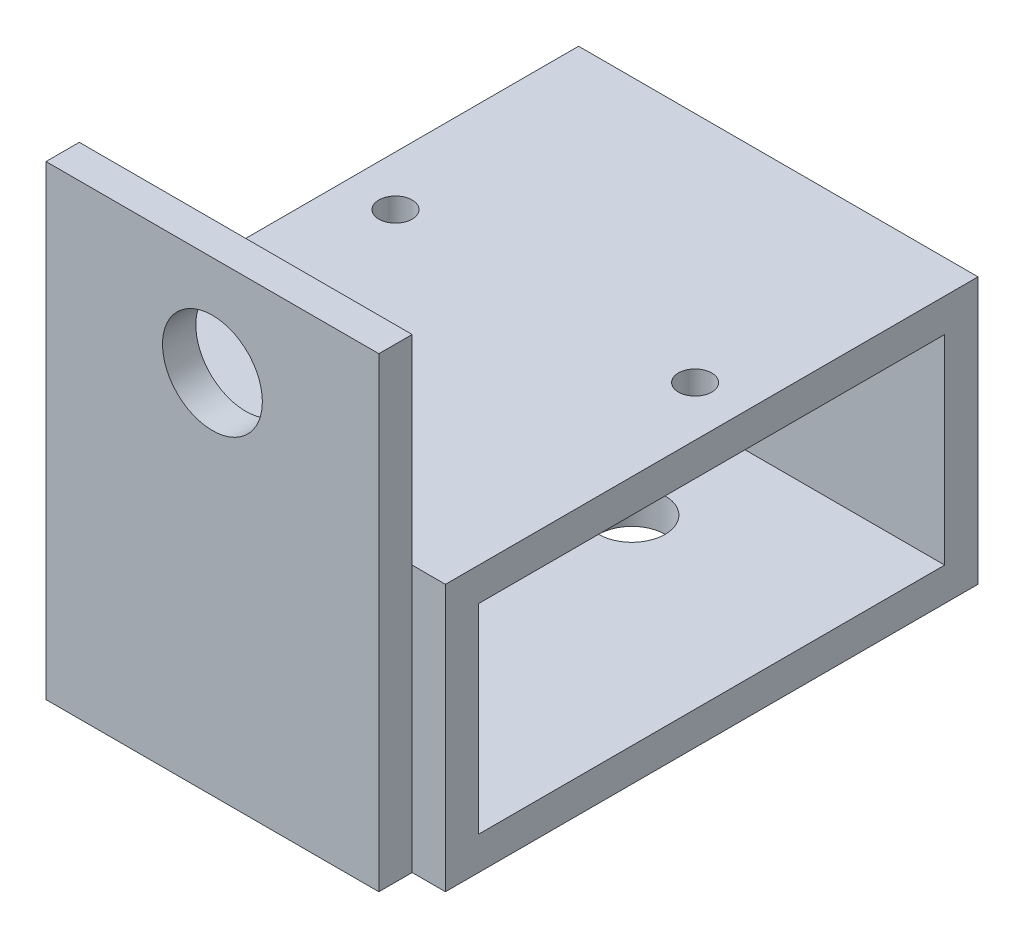
ISO-10303-21;
HEADER;
FILE_DESCRIPTION(('STEP AP214'),'2;1');
FILE_NAME('part.step','',(''),(''),'','','');
FILE_SCHEMA(('AUTOMOTIVE_DESIGN { 1 0 10303 214 1 1 1 1 }'));
ENDSEC;
DATA;
#1=APPLICATION_CONTEXT('core data for automotive mechanical design processes');
#2=APPLICATION_PROTOCOL_DEFINITION('international standard','automotive_design',2000,#1);
#3=PRODUCT_CONTEXT('',#1,'mechanical');
#4=PRODUCT('Part','Part','',(#3));
#5=PRODUCT_RELATED_PRODUCT_CATEGORY('part','',(#4));
#6=PRODUCT_DEFINITION_FORMATION('','',#4);
#7=PRODUCT_DEFINITION_CONTEXT('part definition',#1,'design');
#8=PRODUCT_DEFINITION('design','',#6,#7);
#9=PRODUCT_DEFINITION_SHAPE('','',#8);
#10=(LENGTH_UNIT() NAMED_UNIT(*) SI_UNIT(.MILLI.,.METRE.));
#11=(NAMED_UNIT(*) PLANE_ANGLE_UNIT() SI_UNIT($,.RADIAN.));
#12=(NAMED_UNIT(*) SI_UNIT($,.STERADIAN.) SOLID_ANGLE_UNIT());
#13=UNCERTAINTY_MEASURE_WITH_UNIT(LENGTH_MEASURE(1.E-05),#10,'distance_accuracy_value','');
#14=(GEOMETRIC_REPRESENTATION_CONTEXT(3) GLOBAL_UNCERTAINTY_ASSIGNED_CONTEXT((#13)) GLOBAL_UNIT_ASSIGNED_CONTEXT((#10,
#11,#12)) REPRESENTATION_CONTEXT('',''));
#15=CARTESIAN_POINT('',(0.,0.,0.));
#16=DIRECTION('',(0.,0.,1.));
#17=DIRECTION('',(1.,0.,0.));
#18=AXIS2_PLACEMENT_3D('',#15,#16,#17);
#19=CARTESIAN_POINT('',(19.05,-12.7,25.4));
#20=DIRECTION('',(0.,0.,-1.));
#21=DIRECTION('',(-1.,0.,0.));
#22=AXIS2_PLACEMENT_3D('',#19,#20,#21);
#23=PLANE('',#22);
#24=DIRECTION('',(0.,-1.,0.));
#25=VECTOR('',#24,1.);
#26=CARTESIAN_POINT('',(-15.875,31.75,25.4));
#27=LINE('',#26,#25);
#28=CARTESIAN_POINT('',(-15.875,12.7,25.4));
#29=VERTEX_POINT('',#28);
#30=CARTESIAN_POINT('',(-15.875,-12.7,25.4));
#31=VERTEX_POINT('',#30);
#32=EDGE_CURVE('E12',#29,#31,#27,.T.);
#33=ORIENTED_EDGE('',*,*,#32,.F.);
#34=DIRECTION('',(-1.,0.,0.));
#35=VECTOR('',#34,1.);
#36=CARTESIAN_POINT('',(19.05,12.7,25.4));
#37=LINE('',#36,#35);
#38=CARTESIAN_POINT('',(-19.05,12.7,25.4));
#39=VERTEX_POINT('',#38);
#40=EDGE_CURVE('E290',#29,#39,#37,.T.);
#41=ORIENTED_EDGE('',*,*,#40,.T.);
#42=DIRECTION('',(0.,-1.,0.));
#43=VECTOR('',#42,1.);
#44=CARTESIAN_POINT('',(-19.05,-12.7,25.4));
#45=LINE('',#44,#43);
#46=CARTESIAN_POINT('',(-19.05,-12.7,25.4));
#47=VERTEX_POINT('',#46);
#48=EDGE_CURVE('E260',#39,#47,#45,.T.);
#49=ORIENTED_EDGE('',*,*,#48,.T.);
#50=DIRECTION('',(-1.,0.,0.));
#51=VECTOR('',#50,1.);
#52=CARTESIAN_POINT('',(19.05,-12.7,25.4));
#53=LINE('',#52,#51);
#54=EDGE_CURVE('E196',#31,#47,#53,.T.);
#55=ORIENTED_EDGE('',*,*,#54,.F.);
#56=EDGE_LOOP('',(#33,#41,#49,#55));
#57=FACE_BOUND('',#56,.T.);
#58=ADVANCED_FACE('F59',(#57),#23,.F.);
#59=CARTESIAN_POINT('',(19.05,0.,0.));
#60=DIRECTION('',(1.,0.,0.));
#61=DIRECTION('',(0.,0.,-1.));
#62=AXIS2_PLACEMENT_3D('',#59,#60,#61);
#63=PLANE('',#62);
#64=DIRECTION('',(0.,1.,0.));
#65=VECTOR('',#64,1.);
#66=CARTESIAN_POINT('',(19.05,-12.7,-25.4));
#67=LINE('',#66,#65);
#68=CARTESIAN_POINT('',(19.05,-12.7,-25.4));
#69=VERTEX_POINT('',#68);
#70=CARTESIAN_POINT('',(19.05,12.7,-25.4));
#71=VERTEX_POINT('',#70);
#72=EDGE_CURVE('E259',#69,#71,#67,.T.);
#73=ORIENTED_EDGE('',*,*,#72,.T.);
#74=DIRECTION('',(0.,0.,1.));
#75=VECTOR('',#74,1.);
#76=CARTESIAN_POINT('',(19.05,12.7,25.4));
#77=LINE('',#76,#75);
#78=CARTESIAN_POINT('',(19.05,12.7,25.4));
#79=VERTEX_POINT('',#78);
#80=EDGE_CURVE('E521',#71,#79,#77,.T.);
#81=ORIENTED_EDGE('',*,*,#80,.T.);
#82=DIRECTION('',(0.,-1.,0.));
#83=VECTOR('',#82,1.);
#84=CARTESIAN_POINT('',(19.05,-12.7,25.4));
#85=LINE('',#84,#83);
#86=CARTESIAN_POINT('',(19.05,-12.7,25.4));
#87=VERTEX_POINT('',#86);
#88=EDGE_CURVE('E522',#79,#87,#85,.T.);
#89=ORIENTED_EDGE('',*,*,#88,.T.);
#90=DIRECTION('',(0.,0.,-1.));
#91=VECTOR('',#90,1.);
#92=CARTESIAN_POINT('',(19.05,-12.7,25.4));
#93=LINE('',#92,#91);
#94=EDGE_CURVE('E267',#87,#69,#93,.T.);
#95=ORIENTED_EDGE('',*,*,#94,.T.);
#96=EDGE_LOOP('',(#73,#81,#89,#95));
#97=FACE_BOUND('',#96,.T.);
#98=DIRECTION('',(0.,0.,1.));
#99=VECTOR('',#98,1.);
#100=CARTESIAN_POINT('',(19.05,9.525,0.));
#101=LINE('',#100,#99);
#102=CARTESIAN_POINT('',(19.05,9.525,-22.225));
#103=VERTEX_POINT('',#102);
#104=CARTESIAN_POINT('',(19.05,9.525,22.225));
#105=VERTEX_POINT('',#104);
#106=EDGE_CURVE('E530',#103,#105,#101,.T.);
#107=ORIENTED_EDGE('',*,*,#106,.F.);
#108=DIRECTION('',(0.,1.,0.));
#109=VECTOR('',#108,1.);
#110=CARTESIAN_POINT('',(19.05,0.,-22.225));
#111=LINE('',#110,#109);
#112=CARTESIAN_POINT('',(19.05,-9.525,-22.225));
#113=VERTEX_POINT('',#112);
#114=EDGE_CURVE('E505',#113,#103,#111,.T.);
#115=ORIENTED_EDGE('',*,*,#114,.F.);
#116=DIRECTION('',(0.,0.,-1.));
#117=VECTOR('',#116,1.);
#118=CARTESIAN_POINT('',(19.05,-9.525,0.));
#119=LINE('',#118,#117);
#120=CARTESIAN_POINT('',(19.05,-9.525,22.225));
#121=VERTEX_POINT('',#120);
#122=EDGE_CURVE('E517',#121,#113,#119,.T.);
#123=ORIENTED_EDGE('',*,*,#122,.F.);
#124=DIRECTION('',(0.,-1.,0.));
#125=VECTOR('',#124,1.);
#126=CARTESIAN_POINT('',(19.05,0.,22.225));
#127=LINE('',#126,#125);
#128=EDGE_CURVE('E532',#105,#121,#127,.T.);
#129=ORIENTED_EDGE('',*,*,#128,.F.);
#130=EDGE_LOOP('',(#107,#115,#123,#129));
#131=FACE_BOUND('',#130,.T.);
#132=ADVANCED_FACE('F312',(#97,#131),#63,.T.);
#133=CARTESIAN_POINT('',(-19.05,0.,0.));
#134=DIRECTION('',(1.,0.,0.));
#135=DIRECTION('',(0.,0.,-1.));
#136=AXIS2_PLACEMENT_3D('',#133,#134,#135);
#137=PLANE('',#136);
#138=DIRECTION('',(0.,1.,0.));
#139=VECTOR('',#138,1.);
#140=CARTESIAN_POINT('',(-19.05,-12.7,-25.4));
#141=LINE('',#140,#139);
#142=CARTESIAN_POINT('',(-19.05,-12.7,-25.4));
#143=VERTEX_POINT('',#142);
#144=CARTESIAN_POINT('',(-19.05,12.7,-25.4));
#145=VERTEX_POINT('',#144);
#146=EDGE_CURVE('E265',#143,#145,#141,.T.);
#147=ORIENTED_EDGE('',*,*,#146,.F.);
#148=DIRECTION('',(0.,0.,-1.));
#149=VECTOR('',#148,1.);
#150=CARTESIAN_POINT('',(-19.05,-12.7,25.4));
#151=LINE('',#150,#149);
#152=EDGE_CURVE('E248',#47,#143,#151,.T.);
#153=ORIENTED_EDGE('',*,*,#152,.F.);
#154=ORIENTED_EDGE('',*,*,#48,.F.);
#155=DIRECTION('',(0.,0.,1.));
#156=VECTOR('',#155,1.);
#157=CARTESIAN_POINT('',(-19.05,12.7,25.4));
#158=LINE('',#157,#156);
#159=EDGE_CURVE('E272',#145,#39,#158,.T.);
#160=ORIENTED_EDGE('',*,*,#159,.F.);
#161=EDGE_LOOP('',(#147,#153,#154,#160));
#162=FACE_BOUND('',#161,.T.);
#163=DIRECTION('',(0.,1.,0.));
#164=VECTOR('',#163,1.);
#165=CARTESIAN_POINT('',(-19.05,0.,-22.225));
#166=LINE('',#165,#164);
#167=CARTESIAN_POINT('',(-19.05,-9.525,-22.225));
#168=VERTEX_POINT('',#167);
#169=CARTESIAN_POINT('',(-19.05,9.525,-22.225));
#170=VERTEX_POINT('',#169);
#171=EDGE_CURVE('E189',#168,#170,#166,.T.);
#172=ORIENTED_EDGE('',*,*,#171,.T.);
#173=DIRECTION('',(0.,0.,1.));
#174=VECTOR('',#173,1.);
#175=CARTESIAN_POINT('',(-19.05,9.525,0.));
#176=LINE('',#175,#174);
#177=CARTESIAN_POINT('',(-19.05,9.525,22.225));
#178=VERTEX_POINT('',#177);
#179=EDGE_CURVE('E510',#170,#178,#176,.T.);
#180=ORIENTED_EDGE('',*,*,#179,.T.);
#181=DIRECTION('',(0.,-1.,0.));
#182=VECTOR('',#181,1.);
#183=CARTESIAN_POINT('',(-19.05,0.,22.225));
#184=LINE('',#183,#182);
#185=CARTESIAN_POINT('',(-19.05,-9.525,22.225));
#186=VERTEX_POINT('',#185);
#187=EDGE_CURVE('E506',#178,#186,#184,.T.);
#188=ORIENTED_EDGE('',*,*,#187,.T.);
#189=DIRECTION('',(0.,0.,-1.));
#190=VECTOR('',#189,1.);
#191=CARTESIAN_POINT('',(-19.05,-9.525,0.));
#192=LINE('',#191,#190);
#193=EDGE_CURVE('E500',#186,#168,#192,.T.);
#194=ORIENTED_EDGE('',*,*,#193,.T.);
#195=EDGE_LOOP('',(#172,#180,#188,#194));
#196=FACE_BOUND('',#195,.T.);
#197=ADVANCED_FACE('F269',(#162,#196),#137,.F.);
#198=CARTESIAN_POINT('',(19.05,-12.7,-25.4));
#199=DIRECTION('',(0.,0.,1.));
#200=DIRECTION('',(1.,0.,0.));
#201=AXIS2_PLACEMENT_3D('',#198,#199,#200);
#202=PLANE('',#201);
#203=ORIENTED_EDGE('',*,*,#146,.T.);
#204=DIRECTION('',(-1.,0.,0.));
#205=VECTOR('',#204,1.);
#206=CARTESIAN_POINT('',(19.05,12.7,-25.4));
#207=LINE('',#206,#205);
#208=EDGE_CURVE('E195',#71,#145,#207,.T.);
#209=ORIENTED_EDGE('',*,*,#208,.F.);
#210=ORIENTED_EDGE('',*,*,#72,.F.);
#211=DIRECTION('',(-1.,0.,0.));
#212=VECTOR('',#211,1.);
#213=CARTESIAN_POINT('',(19.05,-12.7,-25.4));
#214=LINE('',#213,#212);
#215=EDGE_CURVE('E251',#69,#143,#214,.T.);
#216=ORIENTED_EDGE('',*,*,#215,.T.);
#217=EDGE_LOOP('',(#203,#209,#210,#216));
#218=FACE_BOUND('',#217,.T.);
#219=ADVANCED_FACE('F61',(#218),#202,.F.);
#220=CARTESIAN_POINT('',(19.05,12.7,25.4));
#221=DIRECTION('',(0.,-1.,0.));
#222=DIRECTION('',(0.,0.,-1.));
#223=AXIS2_PLACEMENT_3D('',#220,#221,#222);
#224=PLANE('',#223);
#225=CARTESIAN_POINT('',(-14.2875,12.7,-3.17500000000001));
#226=DIRECTION('',(0.,1.,0.));
#227=DIRECTION('',(0.,0.,1.));
#228=AXIS2_PLACEMENT_3D('',#225,#226,#227);
#229=CIRCLE('',#228,1.5875);
#230=CARTESIAN_POINT('',(-14.2875,12.7,-1.58750000000001));
#231=VERTEX_POINT('',#230);
#232=EDGE_CURVE('E216',#231,#231,#229,.T.);
#233=ORIENTED_EDGE('',*,*,#232,.F.);
#234=EDGE_LOOP('',(#233));
#235=FACE_BOUND('',#234,.T.);
#236=CARTESIAN_POINT('',(14.2875,12.7,-3.17500000000001));
#237=DIRECTION('',(0.,1.,0.));
#238=DIRECTION('',(0.,0.,1.));
#239=AXIS2_PLACEMENT_3D('',#236,#237,#238);
#240=CIRCLE('',#239,1.5875);
#241=CARTESIAN_POINT('',(14.2875,12.7,-1.58750000000001));
#242=VERTEX_POINT('',#241);
#243=EDGE_CURVE('E207',#242,#242,#240,.T.);
#244=ORIENTED_EDGE('',*,*,#243,.F.);
#245=EDGE_LOOP('',(#244));
#246=FACE_BOUND('',#245,.T.);
#247=ORIENTED_EDGE('',*,*,#159,.T.);
#248=ORIENTED_EDGE('',*,*,#40,.F.);
#249=CARTESIAN_POINT('',(15.875,12.7,25.4));
#250=VERTEX_POINT('',#249);
#251=EDGE_CURVE('E293',#250,#29,#37,.T.);
#252=ORIENTED_EDGE('',*,*,#251,.F.);
#253=EDGE_CURVE('E285',#79,#250,#37,.T.);
#254=ORIENTED_EDGE('',*,*,#253,.F.);
#255=ORIENTED_EDGE('',*,*,#80,.F.);
#256=ORIENTED_EDGE('',*,*,#208,.T.);
#257=EDGE_LOOP('',(#247,#248,#252,#254,#255,#256));
#258=FACE_BOUND('',#257,.T.);
#259=ADVANCED_FACE('F301',(#235,#246,#258),#224,.F.);
#260=ORIENTED_EDGE('',*,*,#253,.T.);
#261=DIRECTION('',(0.,-1.,0.));
#262=VECTOR('',#261,1.);
#263=CARTESIAN_POINT('',(15.875,31.75,25.4));
#264=LINE('',#263,#262);
#265=CARTESIAN_POINT('',(15.875,-12.7,25.4));
#266=VERTEX_POINT('',#265);
#267=EDGE_CURVE('E68',#250,#266,#264,.T.);
#268=ORIENTED_EDGE('',*,*,#267,.T.);
#269=EDGE_CURVE('E288',#87,#266,#53,.T.);
#270=ORIENTED_EDGE('',*,*,#269,.F.);
#271=ORIENTED_EDGE('',*,*,#88,.F.);
#272=EDGE_LOOP('',(#260,#268,#270,#271));
#273=FACE_BOUND('',#272,.T.);
#274=ADVANCED_FACE('F242',(#273),#23,.F.);
#275=CARTESIAN_POINT('',(19.05,-12.7,25.4));
#276=DIRECTION('',(0.,1.,0.));
#277=DIRECTION('',(0.,0.,1.));
#278=AXIS2_PLACEMENT_3D('',#275,#276,#277);
#279=PLANE('',#278);
#280=CARTESIAN_POINT('',(0.,-12.7,11.43));
#281=DIRECTION('',(0.,-1.,0.));
#282=DIRECTION('',(0.,0.,-1.));
#283=AXIS2_PLACEMENT_3D('',#280,#281,#282);
#284=CIRCLE('',#283,3.175);
#285=CARTESIAN_POINT('',(0.,-12.7,8.255));
#286=VERTEX_POINT('',#285);
#287=EDGE_CURVE('E231',#286,#286,#284,.T.);
#288=ORIENTED_EDGE('',*,*,#287,.F.);
#289=EDGE_LOOP('',(#288));
#290=FACE_BOUND('',#289,.T.);
#291=CARTESIAN_POINT('',(0.,-12.7,-11.43));
#292=DIRECTION('',(0.,-1.,0.));
#293=DIRECTION('',(0.,0.,-1.));
#294=AXIS2_PLACEMENT_3D('',#291,#292,#293);
#295=CIRCLE('',#294,3.175);
#296=CARTESIAN_POINT('',(0.,-12.7,-14.605));
#297=VERTEX_POINT('',#296);
#298=EDGE_CURVE('E225',#297,#297,#295,.T.);
#299=ORIENTED_EDGE('',*,*,#298,.F.);
#300=EDGE_LOOP('',(#299));
#301=FACE_BOUND('',#300,.T.);
#302=ORIENTED_EDGE('',*,*,#152,.T.);
#303=ORIENTED_EDGE('',*,*,#215,.F.);
#304=ORIENTED_EDGE('',*,*,#94,.F.);
#305=ORIENTED_EDGE('',*,*,#269,.T.);
#306=DIRECTION('',(0.,0.,-1.));
#307=VECTOR('',#306,1.);
#308=CARTESIAN_POINT('',(15.875,-12.7,0.));
#309=LINE('',#308,#307);
#310=CARTESIAN_POINT('',(15.875,-12.7,28.575));
#311=VERTEX_POINT('',#310);
#312=EDGE_CURVE('E76',#311,#266,#309,.T.);
#313=ORIENTED_EDGE('',*,*,#312,.F.);
#314=DIRECTION('',(1.,0.,0.));
#315=VECTOR('',#314,1.);
#316=CARTESIAN_POINT('',(0.,-12.7,28.575));
#317=LINE('',#316,#315);
#318=CARTESIAN_POINT('',(-15.875,-12.7,28.575));
#319=VERTEX_POINT('',#318);
#320=EDGE_CURVE('E171',#319,#311,#317,.T.);
#321=ORIENTED_EDGE('',*,*,#320,.F.);
#322=DIRECTION('',(0.,0.,1.));
#323=VECTOR('',#322,1.);
#324=CARTESIAN_POINT('',(-15.875,-12.7,0.));
#325=LINE('',#324,#323);
#326=EDGE_CURVE('E178',#31,#319,#325,.T.);
#327=ORIENTED_EDGE('',*,*,#326,.F.);
#328=ORIENTED_EDGE('',*,*,#54,.T.);
#329=EDGE_LOOP('',(#302,#303,#304,#305,#313,#321,#327,#328));
#330=FACE_BOUND('',#329,.T.);
#331=ADVANCED_FACE('F238',(#290,#301,#330),#279,.F.);
#332=CARTESIAN_POINT('',(19.05,0.,-22.225));
#333=DIRECTION('',(0.,0.,1.));
#334=DIRECTION('',(1.,0.,0.));
#335=AXIS2_PLACEMENT_3D('',#332,#333,#334);
#336=PLANE('',#335);
#337=ORIENTED_EDGE('',*,*,#171,.F.);
#338=DIRECTION('',(-1.,0.,0.));
#339=VECTOR('',#338,1.);
#340=CARTESIAN_POINT('',(19.05,-9.525,-22.225));
#341=LINE('',#340,#339);
#342=EDGE_CURVE('E503',#113,#168,#341,.T.);
#343=ORIENTED_EDGE('',*,*,#342,.F.);
#344=ORIENTED_EDGE('',*,*,#114,.T.);
#345=DIRECTION('',(-1.,0.,0.));
#346=VECTOR('',#345,1.);
#347=CARTESIAN_POINT('',(19.05,9.525,-22.225));
#348=LINE('',#347,#346);
#349=EDGE_CURVE('E274',#103,#170,#348,.T.);
#350=ORIENTED_EDGE('',*,*,#349,.T.);
#351=EDGE_LOOP('',(#337,#343,#344,#350));
#352=FACE_BOUND('',#351,.T.);
#353=ADVANCED_FACE('F241',(#352),#336,.T.);
#354=CARTESIAN_POINT('',(19.05,9.525,0.));
#355=DIRECTION('',(0.,-1.,0.));
#356=DIRECTION('',(0.,0.,-1.));
#357=AXIS2_PLACEMENT_3D('',#354,#355,#356);
#358=PLANE('',#357);
#359=CARTESIAN_POINT('',(-14.2875,9.525,-3.17500000000001));
#360=DIRECTION('',(0.,-1.,0.));
#361=DIRECTION('',(0.,0.,-1.));
#362=AXIS2_PLACEMENT_3D('',#359,#360,#361);
#363=CIRCLE('',#362,1.5875);
#364=CARTESIAN_POINT('',(-14.2875,9.525,-4.76250000000001));
#365=VERTEX_POINT('',#364);
#366=EDGE_CURVE('E219',#365,#365,#363,.F.);
#367=ORIENTED_EDGE('',*,*,#366,.T.);
#368=EDGE_LOOP('',(#367));
#369=FACE_BOUND('',#368,.T.);
#370=CARTESIAN_POINT('',(14.2875,9.525,-3.17500000000001));
#371=DIRECTION('',(0.,-1.,0.));
#372=DIRECTION('',(0.,0.,-1.));
#373=AXIS2_PLACEMENT_3D('',#370,#371,#372);
#374=CIRCLE('',#373,1.5875);
#375=CARTESIAN_POINT('',(14.2875,9.525,-4.76250000000001));
#376=VERTEX_POINT('',#375);
#377=EDGE_CURVE('E211',#376,#376,#374,.F.);
#378=ORIENTED_EDGE('',*,*,#377,.T.);
#379=EDGE_LOOP('',(#378));
#380=FACE_BOUND('',#379,.T.);
#381=ORIENTED_EDGE('',*,*,#179,.F.);
#382=ORIENTED_EDGE('',*,*,#349,.F.);
#383=ORIENTED_EDGE('',*,*,#106,.T.);
#384=DIRECTION('',(-1.,0.,0.));
#385=VECTOR('',#384,1.);
#386=CARTESIAN_POINT('',(19.05,9.525,22.225));
#387=LINE('',#386,#385);
#388=EDGE_CURVE('E278',#105,#178,#387,.T.);
#389=ORIENTED_EDGE('',*,*,#388,.T.);
#390=EDGE_LOOP('',(#381,#382,#383,#389));
#391=FACE_BOUND('',#390,.T.);
#392=ADVANCED_FACE('F323',(#369,#380,#391),#358,.T.);
#393=CARTESIAN_POINT('',(19.05,0.,22.225));
#394=DIRECTION('',(0.,0.,-1.));
#395=DIRECTION('',(-1.,0.,0.));
#396=AXIS2_PLACEMENT_3D('',#393,#394,#395);
#397=PLANE('',#396);
#398=ORIENTED_EDGE('',*,*,#187,.F.);
#399=ORIENTED_EDGE('',*,*,#388,.F.);
#400=ORIENTED_EDGE('',*,*,#128,.T.);
#401=DIRECTION('',(-1.,0.,0.));
#402=VECTOR('',#401,1.);
#403=CARTESIAN_POINT('',(19.05,-9.525,22.225));
#404=LINE('',#403,#402);
#405=EDGE_CURVE('E84',#121,#186,#404,.T.);
#406=ORIENTED_EDGE('',*,*,#405,.T.);
#407=EDGE_LOOP('',(#398,#399,#400,#406));
#408=FACE_BOUND('',#407,.T.);
#409=ADVANCED_FACE('F327',(#408),#397,.T.);
#410=CARTESIAN_POINT('',(19.05,-9.525,0.));
#411=DIRECTION('',(0.,1.,0.));
#412=DIRECTION('',(0.,0.,1.));
#413=AXIS2_PLACEMENT_3D('',#410,#411,#412);
#414=PLANE('',#413);
#415=CARTESIAN_POINT('',(0.,-9.525,11.43));
#416=DIRECTION('',(0.,1.,0.));
#417=DIRECTION('',(0.,0.,1.));
#418=AXIS2_PLACEMENT_3D('',#415,#416,#417);
#419=CIRCLE('',#418,3.175);
#420=CARTESIAN_POINT('',(0.,-9.525,14.605));
#421=VERTEX_POINT('',#420);
#422=EDGE_CURVE('E228',#421,#421,#419,.F.);
#423=ORIENTED_EDGE('',*,*,#422,.T.);
#424=EDGE_LOOP('',(#423));
#425=FACE_BOUND('',#424,.T.);
#426=CARTESIAN_POINT('',(0.,-9.525,-11.43));
#427=DIRECTION('',(0.,1.,0.));
#428=DIRECTION('',(0.,0.,1.));
#429=AXIS2_PLACEMENT_3D('',#426,#427,#428);
#430=CIRCLE('',#429,3.175);
#431=CARTESIAN_POINT('',(0.,-9.525,-8.255));
#432=VERTEX_POINT('',#431);
#433=EDGE_CURVE('E222',#432,#432,#430,.F.);
#434=ORIENTED_EDGE('',*,*,#433,.T.);
#435=EDGE_LOOP('',(#434));
#436=FACE_BOUND('',#435,.T.);
#437=ORIENTED_EDGE('',*,*,#193,.F.);
#438=ORIENTED_EDGE('',*,*,#405,.F.);
#439=ORIENTED_EDGE('',*,*,#122,.T.);
#440=ORIENTED_EDGE('',*,*,#342,.T.);
#441=EDGE_LOOP('',(#437,#438,#439,#440));
#442=FACE_BOUND('',#441,.T.);
#443=ADVANCED_FACE('F331',(#425,#436,#442),#414,.T.);
#444=CARTESIAN_POINT('',(0.,31.75,25.4));
#445=DIRECTION('',(0.,0.,1.));
#446=DIRECTION('',(1.,0.,0.));
#447=AXIS2_PLACEMENT_3D('',#444,#445,#446);
#448=PLANE('',#447);
#449=CARTESIAN_POINT('',(0.,22.225,25.4));
#450=DIRECTION('',(0.,0.,1.));
#451=DIRECTION('',(1.,0.,0.));
#452=AXIS2_PLACEMENT_3D('',#449,#450,#451);
#453=CIRCLE('',#452,4.7625);
#454=CARTESIAN_POINT('',(4.7625,22.225,25.4));
#455=VERTEX_POINT('',#454);
#456=EDGE_CURVE('E181',#455,#455,#453,.F.);
#457=ORIENTED_EDGE('',*,*,#456,.F.);
#458=EDGE_LOOP('',(#457));
#459=FACE_BOUND('',#458,.T.);
#460=CARTESIAN_POINT('',(15.875,31.75,25.4));
#461=VERTEX_POINT('',#460);
#462=EDGE_CURVE('E177',#461,#250,#264,.T.);
#463=ORIENTED_EDGE('',*,*,#462,.T.);
#464=ORIENTED_EDGE('',*,*,#251,.T.);
#465=CARTESIAN_POINT('',(-15.875,31.75,25.4));
#466=VERTEX_POINT('',#465);
#467=EDGE_CURVE('E190',#466,#29,#27,.T.);
#468=ORIENTED_EDGE('',*,*,#467,.F.);
#469=DIRECTION('',(-1.,0.,0.));
#470=VECTOR('',#469,1.);
#471=CARTESIAN_POINT('',(0.,31.75,25.4));
#472=LINE('',#471,#470);
#473=EDGE_CURVE('E173',#461,#466,#472,.T.);
#474=ORIENTED_EDGE('',*,*,#473,.F.);
#475=EDGE_LOOP('',(#463,#464,#468,#474));
#476=FACE_BOUND('',#475,.T.);
#477=ADVANCED_FACE('F335',(#459,#476),#448,.F.);
#478=CARTESIAN_POINT('',(15.875,31.75,0.));
#479=DIRECTION('',(-1.,0.,0.));
#480=DIRECTION('',(0.,0.,1.));
#481=AXIS2_PLACEMENT_3D('',#478,#479,#480);
#482=PLANE('',#481);
#483=ORIENTED_EDGE('',*,*,#312,.T.);
#484=ORIENTED_EDGE('',*,*,#267,.F.);
#485=ORIENTED_EDGE('',*,*,#462,.F.);
#486=DIRECTION('',(0.,0.,-1.));
#487=VECTOR('',#486,1.);
#488=CARTESIAN_POINT('',(15.875,31.75,0.));
#489=LINE('',#488,#487);
#490=CARTESIAN_POINT('',(15.875,31.75,28.575));
#491=VERTEX_POINT('',#490);
#492=EDGE_CURVE('E160',#491,#461,#489,.T.);
#493=ORIENTED_EDGE('',*,*,#492,.F.);
#494=DIRECTION('',(0.,-1.,0.));
#495=VECTOR('',#494,1.);
#496=CARTESIAN_POINT('',(15.875,31.75,28.575));
#497=LINE('',#496,#495);
#498=EDGE_CURVE('E168',#491,#311,#497,.T.);
#499=ORIENTED_EDGE('',*,*,#498,.T.);
#500=EDGE_LOOP('',(#483,#484,#485,#493,#499));
#501=FACE_BOUND('',#500,.T.);
#502=ADVANCED_FACE('F175',(#501),#482,.F.);
#503=CARTESIAN_POINT('',(-15.875,31.75,0.));
#504=DIRECTION('',(1.,0.,0.));
#505=DIRECTION('',(0.,0.,-1.));
#506=AXIS2_PLACEMENT_3D('',#503,#504,#505);
#507=PLANE('',#506);
#508=ORIENTED_EDGE('',*,*,#326,.T.);
#509=DIRECTION('',(0.,-1.,0.));
#510=VECTOR('',#509,1.);
#511=CARTESIAN_POINT('',(-15.875,31.75,28.575));
#512=LINE('',#511,#510);
#513=CARTESIAN_POINT('',(-15.875,31.75,28.575));
#514=VERTEX_POINT('',#513);
#515=EDGE_CURVE('E172',#514,#319,#512,.T.);
#516=ORIENTED_EDGE('',*,*,#515,.F.);
#517=DIRECTION('',(0.,0.,1.));
#518=VECTOR('',#517,1.);
#519=CARTESIAN_POINT('',(-15.875,31.75,0.));
#520=LINE('',#519,#518);
#521=EDGE_CURVE('E163',#466,#514,#520,.T.);
#522=ORIENTED_EDGE('',*,*,#521,.F.);
#523=ORIENTED_EDGE('',*,*,#467,.T.);
#524=ORIENTED_EDGE('',*,*,#32,.T.);
#525=EDGE_LOOP('',(#508,#516,#522,#523,#524));
#526=FACE_BOUND('',#525,.T.);
#527=ADVANCED_FACE('F339',(#526),#507,.F.);
#528=CARTESIAN_POINT('',(0.,31.75,28.575));
#529=DIRECTION('',(0.,0.,-1.));
#530=DIRECTION('',(-1.,0.,0.));
#531=AXIS2_PLACEMENT_3D('',#528,#529,#530);
#532=PLANE('',#531);
#533=CARTESIAN_POINT('',(0.,22.225,28.575));
#534=DIRECTION('',(0.,0.,1.));
#535=DIRECTION('',(1.,0.,0.));
#536=AXIS2_PLACEMENT_3D('',#533,#534,#535);
#537=CIRCLE('',#536,4.7625);
#538=CARTESIAN_POINT('',(4.7625,22.225,28.575));
#539=VERTEX_POINT('',#538);
#540=EDGE_CURVE('E203',#539,#539,#537,.T.);
#541=ORIENTED_EDGE('',*,*,#540,.F.);
#542=EDGE_LOOP('',(#541));
#543=FACE_BOUND('',#542,.T.);
#544=ORIENTED_EDGE('',*,*,#320,.T.);
#545=ORIENTED_EDGE('',*,*,#498,.F.);
#546=DIRECTION('',(1.,0.,0.));
#547=VECTOR('',#546,1.);
#548=CARTESIAN_POINT('',(0.,31.75,28.575));
#549=LINE('',#548,#547);
#550=EDGE_CURVE('E156',#514,#491,#549,.T.);
#551=ORIENTED_EDGE('',*,*,#550,.F.);
#552=ORIENTED_EDGE('',*,*,#515,.T.);
#553=EDGE_LOOP('',(#544,#545,#551,#552));
#554=FACE_BOUND('',#553,.T.);
#555=ADVANCED_FACE('F169',(#543,#554),#532,.F.);
#556=CARTESIAN_POINT('',(0.,31.75,0.));
#557=DIRECTION('',(0.,-1.,0.));
#558=DIRECTION('',(0.,0.,-1.));
#559=AXIS2_PLACEMENT_3D('',#556,#557,#558);
#560=PLANE('',#559);
#561=ORIENTED_EDGE('',*,*,#492,.T.);
#562=ORIENTED_EDGE('',*,*,#473,.T.);
#563=ORIENTED_EDGE('',*,*,#521,.T.);
#564=ORIENTED_EDGE('',*,*,#550,.T.);
#565=EDGE_LOOP('',(#561,#562,#563,#564));
#566=FACE_BOUND('',#565,.T.);
#567=ADVANCED_FACE('F158',(#566),#560,.F.);
#568=CARTESIAN_POINT('',(0.,22.225,11.9296158183963));
#569=DIRECTION('',(0.,0.,1.));
#570=DIRECTION('',(1.,0.,0.));
#571=AXIS2_PLACEMENT_3D('',#568,#569,#570);
#572=CYLINDRICAL_SURFACE('',#571,4.7625);
#573=ORIENTED_EDGE('',*,*,#456,.T.);
#574=EDGE_LOOP('',(#573));
#575=FACE_BOUND('',#574,.T.);
#576=ORIENTED_EDGE('',*,*,#540,.T.);
#577=EDGE_LOOP('',(#576));
#578=FACE_BOUND('',#577,.T.);
#579=ADVANCED_FACE('F351',(#575,#578),#572,.F.);
#580=CARTESIAN_POINT('',(14.2875,-12.70105,-3.17500000000001));
#581=DIRECTION('',(0.,1.,0.));
#582=DIRECTION('',(0.,0.,1.));
#583=AXIS2_PLACEMENT_3D('',#580,#581,#582);
#584=CYLINDRICAL_SURFACE('',#583,1.5875);
#585=ORIENTED_EDGE('',*,*,#377,.F.);
#586=EDGE_LOOP('',(#585));
#587=FACE_BOUND('',#586,.T.);
#588=ORIENTED_EDGE('',*,*,#243,.T.);
#589=EDGE_LOOP('',(#588));
#590=FACE_BOUND('',#589,.T.);
#591=ADVANCED_FACE('F354',(#587,#590),#584,.F.);
#592=CARTESIAN_POINT('',(-14.2875,-12.70105,-3.17500000000001));
#593=DIRECTION('',(0.,1.,0.));
#594=DIRECTION('',(0.,0.,1.));
#595=AXIS2_PLACEMENT_3D('',#592,#593,#594);
#596=CYLINDRICAL_SURFACE('',#595,1.5875);
#597=ORIENTED_EDGE('',*,*,#366,.F.);
#598=EDGE_LOOP('',(#597));
#599=FACE_BOUND('',#598,.T.);
#600=ORIENTED_EDGE('',*,*,#232,.T.);
#601=EDGE_LOOP('',(#600));
#602=FACE_BOUND('',#601,.T.);
#603=ADVANCED_FACE('F357',(#599,#602),#596,.F.);
#604=CARTESIAN_POINT('',(0.,-0.544743878930842,-11.43));
#605=DIRECTION('',(0.,-1.,0.));
#606=DIRECTION('',(0.,0.,-1.));
#607=AXIS2_PLACEMENT_3D('',#604,#605,#606);
#608=CYLINDRICAL_SURFACE('',#607,3.175);
#609=ORIENTED_EDGE('',*,*,#298,.T.);
#610=EDGE_LOOP('',(#609));
#611=FACE_BOUND('',#610,.T.);
#612=ORIENTED_EDGE('',*,*,#433,.F.);
#613=EDGE_LOOP('',(#612));
#614=FACE_BOUND('',#613,.T.);
#615=ADVANCED_FACE('F361',(#611,#614),#608,.F.);
#616=CARTESIAN_POINT('',(0.,-0.544743878930842,11.43));
#617=DIRECTION('',(0.,-1.,0.));
#618=DIRECTION('',(0.,0.,-1.));
#619=AXIS2_PLACEMENT_3D('',#616,#617,#618);
#620=CYLINDRICAL_SURFACE('',#619,3.175);
#621=ORIENTED_EDGE('',*,*,#287,.T.);
#622=EDGE_LOOP('',(#621));
#623=FACE_BOUND('',#622,.T.);
#624=ORIENTED_EDGE('',*,*,#422,.F.);
#625=EDGE_LOOP('',(#624));
#626=FACE_BOUND('',#625,.T.);
#627=ADVANCED_FACE('F235',(#623,#626),#620,.F.);
#628=CLOSED_SHELL('',(#58,#132,#197,#219,#259,#274,#331,#353,#392,#409,#443,#477,#502,#527,#555,
#567,#579,#591,#603,#615,#627));
#629=MANIFOLD_SOLID_BREP('B2',#628);
#630=ADVANCED_BREP_SHAPE_REPRESENTATION('',(#18,#629),#14);
#631=SHAPE_DEFINITION_REPRESENTATION(#9,#630);
ENDSEC;
END-ISO-10303-21;
